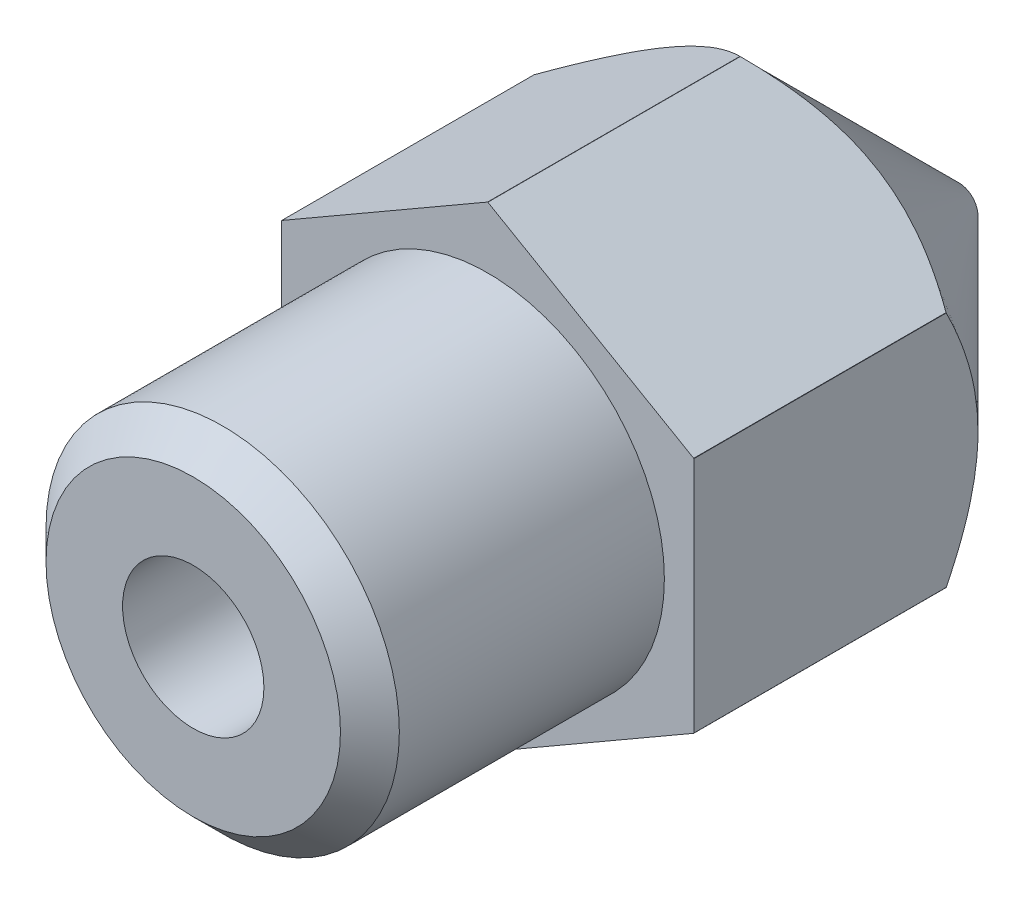
ISO-10303-21;
HEADER;
FILE_DESCRIPTION(('STEP AP214'),'2;1');
FILE_NAME('part.step','',(''),(''),'','','');
FILE_SCHEMA(('AUTOMOTIVE_DESIGN { 1 0 10303 214 1 1 1 1 }'));
ENDSEC;
DATA;
#1=APPLICATION_CONTEXT('core data for automotive mechanical design processes');
#2=APPLICATION_PROTOCOL_DEFINITION('international standard','automotive_design',2000,#1);
#3=PRODUCT_CONTEXT('',#1,'mechanical');
#4=PRODUCT('Part','Part','',(#3));
#5=PRODUCT_RELATED_PRODUCT_CATEGORY('part','',(#4));
#6=PRODUCT_DEFINITION_FORMATION('','',#4);
#7=PRODUCT_DEFINITION_CONTEXT('part definition',#1,'design');
#8=PRODUCT_DEFINITION('design','',#6,#7);
#9=PRODUCT_DEFINITION_SHAPE('','',#8);
#10=(LENGTH_UNIT() NAMED_UNIT(*) SI_UNIT(.MILLI.,.METRE.));
#11=(NAMED_UNIT(*) PLANE_ANGLE_UNIT() SI_UNIT($,.RADIAN.));
#12=(NAMED_UNIT(*) SI_UNIT($,.STERADIAN.) SOLID_ANGLE_UNIT());
#13=UNCERTAINTY_MEASURE_WITH_UNIT(LENGTH_MEASURE(1.E-05),#10,'distance_accuracy_value','');
#14=(GEOMETRIC_REPRESENTATION_CONTEXT(3) GLOBAL_UNCERTAINTY_ASSIGNED_CONTEXT((#13)) GLOBAL_UNIT_ASSIGNED_CONTEXT((#10,
#11,#12)) REPRESENTATION_CONTEXT('',''));
#15=CARTESIAN_POINT('',(0.,0.,0.));
#16=DIRECTION('',(0.,0.,1.));
#17=DIRECTION('',(1.,0.,0.));
#18=AXIS2_PLACEMENT_3D('',#15,#16,#17);
#19=CARTESIAN_POINT('',(-0.2166088223,-17.0652643177,125.63));
#20=DIRECTION('',(0.,0.,1.));
#21=DIRECTION('',(1.,0.,0.));
#22=AXIS2_PLACEMENT_3D('',#19,#20,#21);
#23=CYLINDRICAL_SURFACE('',#22,0.2);
#24=CARTESIAN_POINT('',(-0.2166088223,-17.0652643177,126.129999999932));
#25=DIRECTION('',(0.,0.,1.));
#26=DIRECTION('',(0.,1.,0.));
#27=AXIS2_PLACEMENT_3D('',#24,#25,#26);
#28=CIRCLE('',#27,0.20000000001302);
#29=CARTESIAN_POINT('',(-0.2166088223,-16.865264317687,126.129999999932));
#30=VERTEX_POINT('',#29);
#31=EDGE_CURVE('E333',#30,#30,#28,.T.);
#32=ORIENTED_EDGE('',*,*,#31,.T.);
#33=EDGE_LOOP('',(#32));
#34=FACE_BOUND('',#33,.T.);
#35=CARTESIAN_POINT('',(-0.2166088223,-17.0652643177,125.63));
#36=DIRECTION('',(0.,0.,1.));
#37=DIRECTION('',(1.,0.,0.));
#38=AXIS2_PLACEMENT_3D('',#35,#36,#37);
#39=CIRCLE('',#38,0.2);
#40=CARTESIAN_POINT('',(-0.0166088223,-17.0652643177,125.63));
#41=VERTEX_POINT('',#40);
#42=EDGE_CURVE('E19',#41,#41,#39,.F.);
#43=ORIENTED_EDGE('',*,*,#42,.T.);
#44=EDGE_LOOP('',(#43));
#45=FACE_BOUND('',#44,.T.);
#46=ADVANCED_FACE('F16',(#34,#45),#23,.F.);
#47=CARTESIAN_POINT('',(-0.2166088223,-17.0652643177,125.63));
#48=DIRECTION('',(0.,0.,1.));
#49=DIRECTION('',(1.,0.,0.));
#50=AXIS2_PLACEMENT_3D('',#47,#48,#49);
#51=PLANE('',#50);
#52=ORIENTED_EDGE('',*,*,#42,.F.);
#53=EDGE_LOOP('',(#52));
#54=FACE_BOUND('',#53,.T.);
#55=CARTESIAN_POINT('',(-0.2166088223,-17.0652643177,125.630000000001));
#56=DIRECTION('',(0.,0.,1.));
#57=DIRECTION('',(1.,0.,0.));
#58=AXIS2_PLACEMENT_3D('',#55,#56,#57);
#59=CIRCLE('',#58,0.324999999981642);
#60=CARTESIAN_POINT('',(0.108391177681643,-17.0652643177,125.630000000001));
#61=VERTEX_POINT('',#60);
#62=EDGE_CURVE('E144',#61,#61,#59,.T.);
#63=ORIENTED_EDGE('',*,*,#62,.F.);
#64=EDGE_LOOP('',(#63));
#65=FACE_BOUND('',#64,.T.);
#66=ADVANCED_FACE('F378',(#54,#65),#51,.F.);
#67=CARTESIAN_POINT('',(-0.216608822299999,-17.0652643177,127.862050807551));
#68=DIRECTION('',(0.,0.,1.));
#69=DIRECTION('',(1.,0.,0.));
#70=AXIS2_PLACEMENT_3D('',#67,#68,#69);
#71=CONICAL_SURFACE('',#70,1.20000000004622,0.523598775600348);
#72=CARTESIAN_POINT('',(-0.2166088223,-17.0652643177,127.86205080756));
#73=DIRECTION('',(0.,0.,1.));
#74=DIRECTION('',(1.,0.,0.));
#75=AXIS2_PLACEMENT_3D('',#72,#73,#74);
#76=CIRCLE('',#75,1.2);
#77=CARTESIAN_POINT('',(0.9833911777,-17.0652643177,127.86205080756));
#78=VERTEX_POINT('',#77);
#79=EDGE_CURVE('E131',#78,#78,#76,.T.);
#80=ORIENTED_EDGE('',*,*,#79,.T.);
#81=EDGE_LOOP('',(#80));
#82=FACE_BOUND('',#81,.T.);
#83=ORIENTED_EDGE('',*,*,#31,.F.);
#84=EDGE_LOOP('',(#83));
#85=FACE_BOUND('',#84,.T.);
#86=ADVANCED_FACE('F375',(#82,#85),#71,.F.);
#87=CARTESIAN_POINT('',(-0.2166088223,-17.0652643177,133.63));
#88=DIRECTION('',(0.,0.,-1.));
#89=DIRECTION('',(-1.,0.,0.));
#90=AXIS2_PLACEMENT_3D('',#87,#88,#89);
#91=CYLINDRICAL_SURFACE('',#90,4.04);
#92=CARTESIAN_POINT('',(-0.2166088223,-17.0652643177,133.63));
#93=DIRECTION('',(0.,0.,-1.));
#94=DIRECTION('',(-1.,0.,0.));
#95=AXIS2_PLACEMENT_3D('',#92,#93,#94);
#96=CIRCLE('',#95,4.04);
#97=CARTESIAN_POINT('',(-3.71660882229943,-15.0474437112003,133.63));
#98=VERTEX_POINT('',#97);
#99=CARTESIAN_POINT('',(-3.71409272780585,-15.0430857077009,133.63));
#100=VERTEX_POINT('',#99);
#101=EDGE_CURVE('E122',#98,#100,#96,.T.);
#102=ORIENTED_EDGE('',*,*,#101,.T.);
#103=DIRECTION('',(0.,0.,1.));
#104=VECTOR('',#103,1.);
#105=CARTESIAN_POINT('',(-3.71409272780619,-15.0430857077014,133.63));
#106=LINE('',#105,#104);
#107=CARTESIAN_POINT('',(-3.71409272778886,-15.0430857076914,129.345000000011));
#108=VERTEX_POINT('',#107);
#109=EDGE_CURVE('E120',#108,#100,#106,.T.);
#110=ORIENTED_EDGE('',*,*,#109,.F.);
#111=CARTESIAN_POINT('',(-0.2166088223,-17.0652643177,129.345000000001));
#112=DIRECTION('',(0.,0.,1.));
#113=DIRECTION('',(0.,1.,0.));
#114=AXIS2_PLACEMENT_3D('',#111,#112,#113);
#115=CIRCLE('',#114,4.03999999998133);
#116=CARTESIAN_POINT('',(-3.7166088223,-15.0474437112207,129.345000000001));
#117=VERTEX_POINT('',#116);
#118=EDGE_CURVE('E104',#117,#108,#115,.F.);
#119=ORIENTED_EDGE('',*,*,#118,.F.);
#120=DIRECTION('',(0.,0.,-1.));
#121=VECTOR('',#120,1.);
#122=CARTESIAN_POINT('',(-3.7166088223,-15.0474437112,133.63));
#123=LINE('',#122,#121);
#124=EDGE_CURVE('E266',#117,#98,#123,.F.);
#125=ORIENTED_EDGE('',*,*,#124,.T.);
#126=EDGE_LOOP('',(#102,#110,#119,#125));
#127=FACE_BOUND('',#126,.T.);
#128=ADVANCED_FACE('F121',(#127),#91,.T.);
#129=CARTESIAN_POINT('',(-0.2166088223,-17.0652643177,133.63));
#130=DIRECTION('',(0.,0.,-1.));
#131=DIRECTION('',(-1.,0.,0.));
#132=AXIS2_PLACEMENT_3D('',#129,#130,#131);
#133=CYLINDRICAL_SURFACE('',#132,4.04);
#134=CARTESIAN_POINT('',(-0.2166088223,-17.0652643177,133.63));
#135=DIRECTION('',(0.,0.,-1.));
#136=DIRECTION('',(-1.,0.,0.));
#137=AXIS2_PLACEMENT_3D('',#134,#135,#136);
#138=CIRCLE('',#137,4.04);
#139=CARTESIAN_POINT('',(-3.71409272780752,-19.0874429276897,133.63));
#140=VERTEX_POINT('',#139);
#141=CARTESIAN_POINT('',(-3.71660882230087,-19.0830849241905,133.63));
#142=VERTEX_POINT('',#141);
#143=EDGE_CURVE('E320',#140,#142,#138,.T.);
#144=ORIENTED_EDGE('',*,*,#143,.T.);
#145=DIRECTION('',(0.,0.,-1.));
#146=VECTOR('',#145,1.);
#147=CARTESIAN_POINT('',(-3.7166088223,-19.08308492419,133.63));
#148=LINE('',#147,#146);
#149=CARTESIAN_POINT('',(-3.7166088223,-19.0830849241743,129.345000000009));
#150=VERTEX_POINT('',#149);
#151=EDGE_CURVE('E126',#142,#150,#148,.T.);
#152=ORIENTED_EDGE('',*,*,#151,.T.);
#153=CARTESIAN_POINT('',(-0.2166088223,-17.0652643177,129.345000000001));
#154=DIRECTION('',(0.,0.,1.));
#155=DIRECTION('',(0.,1.,0.));
#156=AXIS2_PLACEMENT_3D('',#153,#154,#155);
#157=CIRCLE('',#156,4.03999999998133);
#158=CARTESIAN_POINT('',(-3.7140927277932,-19.0874429276961,129.345000000001));
#159=VERTEX_POINT('',#158);
#160=EDGE_CURVE('E117',#159,#150,#157,.F.);
#161=ORIENTED_EDGE('',*,*,#160,.F.);
#162=DIRECTION('',(0.,0.,1.));
#163=VECTOR('',#162,1.);
#164=CARTESIAN_POINT('',(-3.71409272780619,-19.0874429276886,133.63));
#165=LINE('',#164,#163);
#166=EDGE_CURVE('E184',#159,#140,#165,.T.);
#167=ORIENTED_EDGE('',*,*,#166,.T.);
#168=EDGE_LOOP('',(#144,#152,#161,#167));
#169=FACE_BOUND('',#168,.T.);
#170=ADVANCED_FACE('F396',(#169),#133,.T.);
#171=CARTESIAN_POINT('',(-0.2166088223,-17.0652643177,133.63));
#172=DIRECTION('',(0.,0.,-1.));
#173=DIRECTION('',(-1.,0.,0.));
#174=AXIS2_PLACEMENT_3D('',#171,#172,#173);
#175=CYLINDRICAL_SURFACE('',#174,4.04);
#176=CARTESIAN_POINT('',(-0.2166088223,-17.0652643177,133.63));
#177=DIRECTION('',(0.,0.,-1.));
#178=DIRECTION('',(-1.,0.,0.));
#179=AXIS2_PLACEMENT_3D('',#176,#177,#178);
#180=CIRCLE('',#179,4.04);
#181=CARTESIAN_POINT('',(-0.214092727807615,-21.1052635341905,133.63));
#182=VERTEX_POINT('',#181);
#183=CARTESIAN_POINT('',(-0.21912491679259,-21.1052635341905,133.63));
#184=VERTEX_POINT('',#183);
#185=EDGE_CURVE('E309',#182,#184,#180,.T.);
#186=ORIENTED_EDGE('',*,*,#185,.T.);
#187=DIRECTION('',(0.,0.,1.));
#188=VECTOR('',#187,1.);
#189=CARTESIAN_POINT('',(-0.219124916791769,-21.1052635341879,133.63));
#190=LINE('',#189,#188);
#191=CARTESIAN_POINT('',(-0.219124916803029,-21.1052635341814,129.345000000007));
#192=VERTEX_POINT('',#191);
#193=EDGE_CURVE('E185',#184,#192,#190,.F.);
#194=ORIENTED_EDGE('',*,*,#193,.T.);
#195=CARTESIAN_POINT('',(-0.2166088223,-17.0652643177,129.345000000001));
#196=DIRECTION('',(0.,0.,1.));
#197=DIRECTION('',(0.,1.,0.));
#198=AXIS2_PLACEMENT_3D('',#195,#196,#197);
#199=CIRCLE('',#198,4.03999999998133);
#200=CARTESIAN_POINT('',(-0.214092727796974,-21.1052635341814,129.345000000001));
#201=VERTEX_POINT('',#200);
#202=EDGE_CURVE('E307',#201,#192,#199,.F.);
#203=ORIENTED_EDGE('',*,*,#202,.F.);
#204=DIRECTION('',(0.,0.,1.));
#205=VECTOR('',#204,1.);
#206=CARTESIAN_POINT('',(-0.214092727808231,-21.1052635341879,133.63));
#207=LINE('',#206,#205);
#208=EDGE_CURVE('E256',#182,#201,#207,.F.);
#209=ORIENTED_EDGE('',*,*,#208,.F.);
#210=EDGE_LOOP('',(#186,#194,#203,#209));
#211=FACE_BOUND('',#210,.T.);
#212=ADVANCED_FACE('F399',(#211),#175,.T.);
#213=CARTESIAN_POINT('',(-0.2166088223,-17.0652643177,133.63));
#214=DIRECTION('',(0.,0.,-1.));
#215=DIRECTION('',(-1.,0.,0.));
#216=AXIS2_PLACEMENT_3D('',#213,#214,#215);
#217=CYLINDRICAL_SURFACE('',#216,4.04);
#218=DIRECTION('',(0.,0.,-1.));
#219=VECTOR('',#218,1.);
#220=CARTESIAN_POINT('',(3.2833911777,-19.08308492419,133.63));
#221=LINE('',#220,#219);
#222=CARTESIAN_POINT('',(3.28339117770087,-19.0830849241905,133.63));
#223=VERTEX_POINT('',#222);
#224=CARTESIAN_POINT('',(3.2833911777,-19.0830849241743,129.345000000001));
#225=VERTEX_POINT('',#224);
#226=EDGE_CURVE('E242',#223,#225,#221,.T.);
#227=ORIENTED_EDGE('',*,*,#226,.F.);
#228=CARTESIAN_POINT('',(-0.2166088223,-17.0652643177,133.63));
#229=DIRECTION('',(0.,0.,-1.));
#230=DIRECTION('',(-1.,0.,0.));
#231=AXIS2_PLACEMENT_3D('',#228,#229,#230);
#232=CIRCLE('',#231,4.04);
#233=CARTESIAN_POINT('',(3.28087508320753,-19.0874429276898,133.63));
#234=VERTEX_POINT('',#233);
#235=EDGE_CURVE('E299',#223,#234,#232,.T.);
#236=ORIENTED_EDGE('',*,*,#235,.T.);
#237=DIRECTION('',(0.,0.,1.));
#238=VECTOR('',#237,1.);
#239=CARTESIAN_POINT('',(3.28087508320619,-19.0874429276886,133.63));
#240=LINE('',#239,#238);
#241=CARTESIAN_POINT('',(3.2808750831932,-19.0874429276961,129.345000000008));
#242=VERTEX_POINT('',#241);
#243=EDGE_CURVE('E245',#242,#234,#240,.T.);
#244=ORIENTED_EDGE('',*,*,#243,.F.);
#245=CARTESIAN_POINT('',(-0.2166088223,-17.0652643177,129.345000000001));
#246=DIRECTION('',(0.,0.,1.));
#247=DIRECTION('',(0.,1.,0.));
#248=AXIS2_PLACEMENT_3D('',#245,#246,#247);
#249=CIRCLE('',#248,4.03999999998133);
#250=EDGE_CURVE('E296',#225,#242,#249,.F.);
#251=ORIENTED_EDGE('',*,*,#250,.F.);
#252=EDGE_LOOP('',(#227,#236,#244,#251));
#253=FACE_BOUND('',#252,.T.);
#254=ADVANCED_FACE('F402',(#253),#217,.T.);
#255=CARTESIAN_POINT('',(-0.2166088223,-17.0652643177,133.63));
#256=DIRECTION('',(0.,0.,-1.));
#257=DIRECTION('',(-1.,0.,0.));
#258=AXIS2_PLACEMENT_3D('',#255,#256,#257);
#259=CYLINDRICAL_SURFACE('',#258,4.04);
#260=DIRECTION('',(0.,0.,1.));
#261=VECTOR('',#260,1.);
#262=CARTESIAN_POINT('',(3.28087508320823,-15.0430857076979,133.63));
#263=LINE('',#262,#261);
#264=CARTESIAN_POINT('',(3.28087508320652,-15.0430857076996,133.63));
#265=VERTEX_POINT('',#264);
#266=CARTESIAN_POINT('',(3.28087508318784,-15.0430857076861,129.345000000001));
#267=VERTEX_POINT('',#266);
#268=EDGE_CURVE('E243',#265,#267,#263,.F.);
#269=ORIENTED_EDGE('',*,*,#268,.F.);
#270=CARTESIAN_POINT('',(-0.2166088223,-17.0652643177,133.63));
#271=DIRECTION('',(0.,0.,-1.));
#272=DIRECTION('',(-1.,0.,0.));
#273=AXIS2_PLACEMENT_3D('',#270,#271,#272);
#274=CIRCLE('',#273,4.04);
#275=CARTESIAN_POINT('',(3.28339117769943,-15.0474437112004,133.63));
#276=VERTEX_POINT('',#275);
#277=EDGE_CURVE('E297',#265,#276,#274,.T.);
#278=ORIENTED_EDGE('',*,*,#277,.T.);
#279=DIRECTION('',(0.,0.,-1.));
#280=VECTOR('',#279,1.);
#281=CARTESIAN_POINT('',(3.2833911777,-15.0474437112,133.63));
#282=LINE('',#281,#280);
#283=CARTESIAN_POINT('',(3.2833911777,-15.0474437112207,129.345000000011));
#284=VERTEX_POINT('',#283);
#285=EDGE_CURVE('E239',#284,#276,#282,.F.);
#286=ORIENTED_EDGE('',*,*,#285,.F.);
#287=CARTESIAN_POINT('',(-0.2166088223,-17.0652643177,129.345000000001));
#288=DIRECTION('',(0.,0.,1.));
#289=DIRECTION('',(0.,1.,0.));
#290=AXIS2_PLACEMENT_3D('',#287,#288,#289);
#291=CIRCLE('',#290,4.03999999998133);
#292=EDGE_CURVE('E294',#267,#284,#291,.F.);
#293=ORIENTED_EDGE('',*,*,#292,.F.);
#294=EDGE_LOOP('',(#269,#278,#286,#293));
#295=FACE_BOUND('',#294,.T.);
#296=ADVANCED_FACE('F152',(#295),#259,.T.);
#297=CARTESIAN_POINT('',(-0.2166088223,-17.0652643177,129.345000000058));
#298=DIRECTION('',(0.,0.,1.));
#299=DIRECTION('',(1.,0.,0.));
#300=AXIS2_PLACEMENT_3D('',#297,#298,#299);
#301=CONICAL_SURFACE('',#300,4.04000000003818,0.785398163397448);
#302=CARTESIAN_POINT('',(-0.219124916802233,-13.0252651012076,129.345000000018));
#303=CARTESIAN_POINT('',(-0.33927015428237,-13.094630986409,129.275774840659));
#304=CARTESIAN_POINT('',(-0.461422701634482,-13.1651557925051,129.210622890685));
#305=CARTESIAN_POINT('',(-0.710495407702024,-13.3089579864012,129.091344654386));
#306=CARTESIAN_POINT('',(-0.837439107572412,-13.3822489656933,129.037284502365));
#307=CARTESIAN_POINT('',(-1.09341317875045,-13.5300356645935,128.94468597697));
#308=CARTESIAN_POINT('',(-1.22237875070989,-13.6044939722806,128.905915538767));
#309=CARTESIAN_POINT('',(-1.48314097540406,-13.7550451129023,128.846188889384));
#310=CARTESIAN_POINT('',(-1.614929723699,-13.8311333822066,128.825188280028));
#311=CARTESIAN_POINT('',(-1.84219844470857,-13.9623470394599,128.806235193616));
#312=CARTESIAN_POINT('',(-1.93738707452634,-14.017304220509,128.803438549926));
#313=CARTESIAN_POINT('',(-2.12760799384724,-14.1271283194845,128.808215092515));
#314=CARTESIAN_POINT('',(-2.22264021700774,-14.1819951991079,128.815791906852));
#315=CARTESIAN_POINT('',(-2.4118026976506,-14.2912082082277,128.84088266067));
#316=CARTESIAN_POINT('',(-2.5059318331084,-14.3455536899229,128.858407654472));
#317=CARTESIAN_POINT('',(-2.69257289849409,-14.4533109592652,128.902438581097));
#318=CARTESIAN_POINT('',(-2.78508495233469,-14.5067228184534,128.928943822586));
#319=CARTESIAN_POINT('',(-2.94905033180317,-14.6013882744274,128.983382150048));
#320=CARTESIAN_POINT('',(-3.02087185803901,-14.6428544519333,129.009864691701));
#321=CARTESIAN_POINT('',(-3.16323028929422,-14.7250451305399,129.067083015351));
#322=CARTESIAN_POINT('',(-3.23376716053279,-14.7657696121373,129.097818909011));
#323=CARTESIAN_POINT('',(-3.37333358275448,-14.8463483235769,129.162858692339));
#324=CARTESIAN_POINT('',(-3.44236709758791,-14.8862048419491,129.197151334449));
#325=CARTESIAN_POINT('',(-3.57916063016628,-14.9651826248066,129.268857758395));
#326=CARTESIAN_POINT('',(-3.64692138653187,-15.0043043157348,129.306269656864));
#327=CARTESIAN_POINT('',(-3.71409272779723,-15.0430857076962,129.345000000016));
#328=B_SPLINE_CURVE_WITH_KNOTS('',3,(#302,#303,#304,#305,#306,#307,#308,#309,#310,#311,#312,
#313,#314,#315,#316,#317,#318,#319,#320,#321,#322,#323,#324,#325,#326,#327),.UNSPECIFIED.,.F.,
.F.,(4,2,2,2,2,2,2,2,2,2,2,2,4),(0.,0.465452894214237,0.933605168055278,1.3943499151764,
1.85394005677302,2.18332351499273,2.51282220261936,2.84268774472414,3.17252789830372,
3.4335806232525,3.69464020286406,3.95489804276275,4.21499986468729),.UNSPECIFIED.);
#329=CARTESIAN_POINT('',(-0.219124916811697,-13.0252651012136,129.345000000001));
#330=VERTEX_POINT('',#329);
#331=EDGE_CURVE('E109',#330,#108,#328,.T.);
#332=ORIENTED_EDGE('',*,*,#331,.F.);
#333=CARTESIAN_POINT('',(-0.216608822300003,-17.0652643177,129.345));
#334=DIRECTION('',(0.,0.,-1.));
#335=DIRECTION('',(-1.,0.,0.));
#336=AXIS2_PLACEMENT_3D('',#333,#334,#335);
#337=CIRCLE('',#336,4.04);
#338=CARTESIAN_POINT('',(-0.214092727799382,-13.0252651012025,129.345000000014));
#339=VERTEX_POINT('',#338);
#340=EDGE_CURVE('E99',#339,#330,#337,.F.);
#341=ORIENTED_EDGE('',*,*,#340,.F.);
#342=CARTESIAN_POINT('',(3.28087508319829,-15.0430857076917,129.345000000018));
#343=CARTESIAN_POINT('',(3.16072984571819,-14.973719822491,129.27577484066));
#344=CARTESIAN_POINT('',(3.03857729836627,-14.9031950163952,129.210622890687));
#345=CARTESIAN_POINT('',(2.78950459229927,-14.7593928224996,129.091344654388));
#346=CARTESIAN_POINT('',(2.66256089242924,-14.6861018432077,129.037284502367));
#347=CARTESIAN_POINT('',(2.4065868212519,-14.5383151443078,128.944685976973));
#348=CARTESIAN_POINT('',(2.2776212492928,-14.463856836621,128.90591553877));
#349=CARTESIAN_POINT('',(2.01685902459937,-14.3133056959997,128.846188889388));
#350=CARTESIAN_POINT('',(1.88507027630481,-14.2372174266956,128.825188280032));
#351=CARTESIAN_POINT('',(1.65780155529555,-14.1060037694425,128.80623519362));
#352=CARTESIAN_POINT('',(1.5626129254777,-14.0510465883933,128.80343854993));
#353=CARTESIAN_POINT('',(1.37239200615663,-13.9412224894177,128.80821509252));
#354=CARTESIAN_POINT('',(1.27735978299604,-13.8863556097942,128.815791906856));
#355=CARTESIAN_POINT('',(1.08819730235302,-13.7771426006744,128.840882660674));
#356=CARTESIAN_POINT('',(0.994068166895133,-13.7227971189791,128.858407654477));
#357=CARTESIAN_POINT('',(0.807427101509272,-13.6150398496367,128.902438581101));
#358=CARTESIAN_POINT('',(0.714915047668595,-13.5616279904485,128.92894382259));
#359=CARTESIAN_POINT('',(0.550949668199817,-13.4669625344744,128.983382150053));
#360=CARTESIAN_POINT('',(0.479128141963763,-13.4254963569683,129.009864691706));
#361=CARTESIAN_POINT('',(0.336769710708124,-13.3433056783614,129.067083015356));
#362=CARTESIAN_POINT('',(0.266232839469348,-13.3025811967639,129.097818909016));
#363=CARTESIAN_POINT('',(0.126666417247241,-13.2220024853241,129.162858692344));
#364=CARTESIAN_POINT('',(0.0576329024136132,-13.1821459669518,129.197151334454));
#365=CARTESIAN_POINT('',(-0.0791606301651576,-13.103168184094,129.268857758401));
#366=CARTESIAN_POINT('',(-0.146921386530942,-13.0640464931657,129.306269656869));
#367=CARTESIAN_POINT('',(-0.214092727796492,-13.0252651012042,129.345000000022));
#368=B_SPLINE_CURVE_WITH_KNOTS('',3,(#342,#343,#344,#345,#346,#347,#348,#349,#350,#351,#352,
#353,#354,#355,#356,#357,#358,#359,#360,#361,#362,#363,#364,#365,#366,#367),.UNSPECIFIED.,.F.,
.F.,(4,2,2,2,2,2,2,2,2,2,2,2,4),(0.,0.465452894212852,0.933605168052482,1.39434991517221,
1.85394005676747,2.18332351498747,2.5128222026144,2.84268774471948,3.17252789829938,
3.43358062324897,3.69464020286134,3.95489804276083,4.21499986468618),.UNSPECIFIED.);
#369=EDGE_CURVE('E159',#267,#339,#368,.T.);
#370=ORIENTED_EDGE('',*,*,#369,.F.);
#371=ORIENTED_EDGE('',*,*,#292,.T.);
#372=CARTESIAN_POINT('',(3.2833911777,-19.083084924182,129.345000000012));
#373=CARTESIAN_POINT('',(3.2833911777,-18.9443531537803,129.275774840654));
#374=CARTESIAN_POINT('',(3.2833911777,-18.8033035415888,129.210622890681));
#375=CARTESIAN_POINT('',(3.2833911777,-18.515699153798,129.091344654382));
#376=CARTESIAN_POINT('',(3.2833911777,-18.3691171952144,129.037284502361));
#377=CARTESIAN_POINT('',(3.2833911777,-18.073543797415,128.944685976967));
#378=CARTESIAN_POINT('',(3.2833911777,-17.9246271820416,128.905915538764));
#379=CARTESIAN_POINT('',(3.2833911777,-17.6235249007994,128.846188889382));
#380=CARTESIAN_POINT('',(3.2833911777,-17.4713483621915,128.825188280026));
#381=CARTESIAN_POINT('',(3.2833911777,-17.2089210476857,128.806235193614));
#382=CARTESIAN_POINT('',(3.2833911777,-17.0990066855876,128.803438549925));
#383=CARTESIAN_POINT('',(3.2833911777,-16.8793584876369,128.808215092514));
#384=CARTESIAN_POINT('',(3.2833911777,-16.7696247283901,128.81579190685));
#385=CARTESIAN_POINT('',(3.2833911777,-16.5511987101508,128.840882660668));
#386=CARTESIAN_POINT('',(3.2833911777,-16.4425077467606,128.85840765447));
#387=CARTESIAN_POINT('',(3.2833911777,-16.2269932080762,128.902438581095));
#388=CARTESIAN_POINT('',(3.2833911777,-16.1201694897,128.928943822584));
#389=CARTESIAN_POINT('',(3.2833911777,-15.9308385777518,128.983382150046));
#390=CARTESIAN_POINT('',(3.2833911777,-15.8479062227397,129.0098646917));
#391=CARTESIAN_POINT('',(3.2833911777,-15.6835248655257,129.06708301535));
#392=CARTESIAN_POINT('',(3.2833911777,-15.6020759023306,129.09781890901));
#393=CARTESIAN_POINT('',(3.2833911777,-15.4409184794508,129.162858692338));
#394=CARTESIAN_POINT('',(3.2833911777,-15.3612054427061,129.197151334448));
#395=CARTESIAN_POINT('',(3.2833911777,-15.2032498769903,129.268857758395));
#396=CARTESIAN_POINT('',(3.2833911777,-15.1250064951336,129.306269656864));
#397=CARTESIAN_POINT('',(3.2833911777,-15.0474437112106,129.345000000016));
#398=B_SPLINE_CURVE_WITH_KNOTS('',3,(#372,#373,#374,#375,#376,#377,#378,#379,#380,#381,#382,
#383,#384,#385,#386,#387,#388,#389,#390,#391,#392,#393,#394,#395,#396,#397),.UNSPECIFIED.,.F.,
.F.,(4,2,2,2,2,2,2,2,2,2,2,2,4),(0.,0.465452894212396,0.93360516805157,1.39434991517083,
1.85394005676561,2.18332351498506,2.51282220261143,2.84268774471595,3.17252789829529,
3.4335806232453,3.69464020285807,3.95489804275796,4.21499986468369),.UNSPECIFIED.);
#399=EDGE_CURVE('E167',#225,#284,#398,.T.);
#400=ORIENTED_EDGE('',*,*,#399,.F.);
#401=ORIENTED_EDGE('',*,*,#250,.T.);
#402=CARTESIAN_POINT('',(-0.21409272780224,-21.1052635341844,129.34500000001));
#403=CARTESIAN_POINT('',(-0.0939474903220502,-21.0358976489833,129.275774840651));
#404=CARTESIAN_POINT('',(0.0282050570300573,-20.9653728428874,129.210622890678));
#405=CARTESIAN_POINT('',(0.277277763097548,-20.8215706489914,129.091344654378));
#406=CARTESIAN_POINT('',(0.40422146296789,-20.7482796696993,129.037284502357));
#407=CARTESIAN_POINT('',(0.660195534145842,-20.6004929707991,128.944685976962));
#408=CARTESIAN_POINT('',(0.789161106105236,-20.5260346631121,128.905915538758));
#409=CARTESIAN_POINT('',(1.04992333079932,-20.3754835224904,128.846188889376));
#410=CARTESIAN_POINT('',(1.18171207909422,-20.2993952531862,128.825188280019));
#411=CARTESIAN_POINT('',(1.40898080010353,-20.168181595933,128.806235193608));
#412=CARTESIAN_POINT('',(1.50416942992106,-20.113224414884,128.803438549918));
#413=CARTESIAN_POINT('',(1.6943903492415,-20.0034003159088,128.808215092507));
#414=CARTESIAN_POINT('',(1.78942257240178,-19.9485334362855,128.815791906843));
#415=CARTESIAN_POINT('',(1.97858505304419,-19.839320427166,128.840882660661));
#416=CARTESIAN_POINT('',(2.07271418850177,-19.7849749454709,128.858407654463));
#417=CARTESIAN_POINT('',(2.25935525388703,-19.6772176761288,128.902438581088));
#418=CARTESIAN_POINT('',(2.35186730772742,-19.6238058169408,128.928943822577));
#419=CARTESIAN_POINT('',(2.51583268719656,-19.5291403609665,128.983382150039));
#420=CARTESIAN_POINT('',(2.58765421343326,-19.4876741834601,129.009864691692));
#421=CARTESIAN_POINT('',(2.73001264469015,-19.4054835048524,129.067083015343));
#422=CARTESIAN_POINT('',(2.80054951592954,-19.3647590232546,129.097818909003));
#423=CARTESIAN_POINT('',(2.94011593815284,-19.2841803118141,129.162858692332));
#424=CARTESIAN_POINT('',(3.00914945298706,-19.2443237934414,129.197151334443));
#425=CARTESIAN_POINT('',(3.14594298556697,-19.165346010583,129.26885775839));
#426=CARTESIAN_POINT('',(3.21370374193331,-19.1262243196543,129.306269656859));
#427=CARTESIAN_POINT('',(3.2808750831994,-19.0874429276925,129.345000000012));
#428=B_SPLINE_CURVE_WITH_KNOTS('',3,(#402,#403,#404,#405,#406,#407,#408,#409,#410,#411,#412,
#413,#414,#415,#416,#417,#418,#419,#420,#421,#422,#423,#424,#425,#426,#427),.UNSPECIFIED.,.F.,
.F.,(4,2,2,2,2,2,2,2,2,2,2,2,4),(0.,0.465452894214223,0.933605168055257,1.39434991517627,
1.8539400567728,2.18332351499171,2.51282220261755,2.84268774472153,3.17252789830034,
3.43358062325225,3.69464020286694,3.95489804276874,4.21499986469639),.UNSPECIFIED.);
#429=EDGE_CURVE('E173',#201,#242,#428,.T.);
#430=ORIENTED_EDGE('',*,*,#429,.F.);
#431=ORIENTED_EDGE('',*,*,#202,.T.);
#432=CARTESIAN_POINT('',(-0.219124916797763,-21.1052635341844,129.34500000001));
#433=CARTESIAN_POINT('',(-0.339270154277953,-21.0358976489833,129.275774840651));
#434=CARTESIAN_POINT('',(-0.461422701630059,-20.9653728428874,129.210622890678));
#435=CARTESIAN_POINT('',(-0.710495407697548,-20.8215706489914,129.091344654378));
#436=CARTESIAN_POINT('',(-0.837439107567888,-20.7482796696993,129.037284502357));
#437=CARTESIAN_POINT('',(-1.09341317874584,-20.6004929707991,128.944685976962));
#438=CARTESIAN_POINT('',(-1.22237875070524,-20.5260346631121,128.905915538758));
#439=CARTESIAN_POINT('',(-1.48314097539932,-20.3754835224904,128.846188889376));
#440=CARTESIAN_POINT('',(-1.61492972369423,-20.2993952531862,128.825188280019));
#441=CARTESIAN_POINT('',(-1.84219844470353,-20.168181595933,128.806235193608));
#442=CARTESIAN_POINT('',(-1.93738707452106,-20.113224414884,128.803438549918));
#443=CARTESIAN_POINT('',(-2.12760799384151,-20.0034003159088,128.808215092507));
#444=CARTESIAN_POINT('',(-2.22264021700179,-19.9485334362855,128.815791906843));
#445=CARTESIAN_POINT('',(-2.4118026976442,-19.839320427166,128.840882660661));
#446=CARTESIAN_POINT('',(-2.50593183310177,-19.7849749454709,128.858407654463));
#447=CARTESIAN_POINT('',(-2.69257289848704,-19.6772176761288,128.902438581088));
#448=CARTESIAN_POINT('',(-2.78508495232742,-19.6238058169408,128.928943822577));
#449=CARTESIAN_POINT('',(-2.94905033179656,-19.5291403609665,128.983382150039));
#450=CARTESIAN_POINT('',(-3.02087185803325,-19.4876741834601,129.009864691692));
#451=CARTESIAN_POINT('',(-3.16323028929015,-19.4054835048524,129.067083015343));
#452=CARTESIAN_POINT('',(-3.23376716052954,-19.3647590232546,129.097818909003));
#453=CARTESIAN_POINT('',(-3.37333358275284,-19.2841803118141,129.162858692332));
#454=CARTESIAN_POINT('',(-3.44236709758705,-19.2443237934414,129.197151334443));
#455=CARTESIAN_POINT('',(-3.57916063016697,-19.165346010583,129.26885775839));
#456=CARTESIAN_POINT('',(-3.64692138653331,-19.1262243196543,129.306269656859));
#457=CARTESIAN_POINT('',(-3.7140927277994,-19.0874429276925,129.345000000012));
#458=B_SPLINE_CURVE_WITH_KNOTS('',3,(#432,#433,#434,#435,#436,#437,#438,#439,#440,#441,#442,
#443,#444,#445,#446,#447,#448,#449,#450,#451,#452,#453,#454,#455,#456,#457),.UNSPECIFIED.,.F.,
.F.,(4,2,2,2,2,2,2,2,2,2,2,2,4),(0.,0.465452894214224,0.933605168055252,1.39434991517628,
1.8539400567728,2.18332351499171,2.51282220261755,2.84268774472154,3.17252789830034,
3.43358062325224,3.69464020286694,3.95489804276874,4.21499986469638),.UNSPECIFIED.);
#459=EDGE_CURVE('E178',#192,#159,#458,.T.);
#460=ORIENTED_EDGE('',*,*,#459,.T.);
#461=ORIENTED_EDGE('',*,*,#160,.T.);
#462=CARTESIAN_POINT('',(-3.7166088223,-19.083084924182,129.345000000012));
#463=CARTESIAN_POINT('',(-3.7166088223,-18.9443531537803,129.275774840654));
#464=CARTESIAN_POINT('',(-3.7166088223,-18.8033035415888,129.210622890681));
#465=CARTESIAN_POINT('',(-3.7166088223,-18.515699153798,129.091344654382));
#466=CARTESIAN_POINT('',(-3.7166088223,-18.3691171952143,129.037284502361));
#467=CARTESIAN_POINT('',(-3.7166088223,-18.073543797415,128.944685976967));
#468=CARTESIAN_POINT('',(-3.7166088223,-17.9246271820416,128.905915538764));
#469=CARTESIAN_POINT('',(-3.7166088223,-17.6235249007994,128.846188889382));
#470=CARTESIAN_POINT('',(-3.7166088223,-17.4713483621915,128.825188280026));
#471=CARTESIAN_POINT('',(-3.7166088223,-17.2089210476856,128.806235193614));
#472=CARTESIAN_POINT('',(-3.7166088223,-17.0990066855875,128.803438549925));
#473=CARTESIAN_POINT('',(-3.7166088223,-16.8793584876368,128.808215092514));
#474=CARTESIAN_POINT('',(-3.7166088223,-16.7696247283901,128.81579190685));
#475=CARTESIAN_POINT('',(-3.7166088223,-16.5511987101508,128.840882660668));
#476=CARTESIAN_POINT('',(-3.7166088223,-16.4425077467605,128.858407654471));
#477=CARTESIAN_POINT('',(-3.7166088223,-16.2269932080761,128.902438581095));
#478=CARTESIAN_POINT('',(-3.7166088223,-16.1201694896999,128.928943822584));
#479=CARTESIAN_POINT('',(-3.7166088223,-15.9308385777518,128.983382150046));
#480=CARTESIAN_POINT('',(-3.7166088223,-15.8479062227396,129.0098646917));
#481=CARTESIAN_POINT('',(-3.7166088223,-15.6835248655257,129.06708301535));
#482=CARTESIAN_POINT('',(-3.7166088223,-15.6020759023305,129.09781890901));
#483=CARTESIAN_POINT('',(-3.7166088223,-15.4409184794508,129.162858692338));
#484=CARTESIAN_POINT('',(-3.7166088223,-15.3612054427061,129.197151334448));
#485=CARTESIAN_POINT('',(-3.7166088223,-15.2032498769903,129.268857758395));
#486=CARTESIAN_POINT('',(-3.7166088223,-15.1250064951336,129.306269656864));
#487=CARTESIAN_POINT('',(-3.7166088223,-15.0474437112105,129.345000000016));
#488=B_SPLINE_CURVE_WITH_KNOTS('',3,(#462,#463,#464,#465,#466,#467,#468,#469,#470,#471,#472,
#473,#474,#475,#476,#477,#478,#479,#480,#481,#482,#483,#484,#485,#486,#487),.UNSPECIFIED.,.F.,
.F.,(4,2,2,2,2,2,2,2,2,2,2,2,4),(0.,0.465452894212415,0.933605168051599,1.39434991517087,
1.85394005676566,2.1833235149851,2.51282220261148,2.84268774471601,3.17252789829536,
3.43358062324534,3.69464020285811,3.95489804275796,4.21499986468369),.UNSPECIFIED.);
#489=EDGE_CURVE('E113',#150,#117,#488,.T.);
#490=ORIENTED_EDGE('',*,*,#489,.T.);
#491=ORIENTED_EDGE('',*,*,#118,.T.);
#492=EDGE_LOOP('',(#332,#341,#370,#371,#400,#401,#430,#431,#460,#461,#490,#491));
#493=FACE_BOUND('',#492,.T.);
#494=ORIENTED_EDGE('',*,*,#62,.T.);
#495=EDGE_LOOP('',(#494));
#496=FACE_BOUND('',#495,.T.);
#497=ADVANCED_FACE('F106',(#493,#496),#301,.T.);
#498=CARTESIAN_POINT('',(-0.2166088223,-17.0652643177,133.63));
#499=DIRECTION('',(0.,0.,-1.));
#500=DIRECTION('',(-1.,0.,0.));
#501=AXIS2_PLACEMENT_3D('',#498,#499,#500);
#502=CYLINDRICAL_SURFACE('',#501,4.04);
#503=ORIENTED_EDGE('',*,*,#340,.T.);
#504=DIRECTION('',(0.,0.,1.));
#505=VECTOR('',#504,1.);
#506=CARTESIAN_POINT('',(-0.21912491679177,-13.0252651012021,133.63));
#507=LINE('',#506,#505);
#508=CARTESIAN_POINT('',(-0.219124577486317,-13.0252649705491,133.63));
#509=VERTEX_POINT('',#508);
#510=EDGE_CURVE('E129',#509,#330,#507,.F.);
#511=ORIENTED_EDGE('',*,*,#510,.F.);
#512=CARTESIAN_POINT('',(-0.2166088223,-17.0652643177,133.63));
#513=DIRECTION('',(0.,0.,-1.));
#514=DIRECTION('',(-1.,0.,0.));
#515=AXIS2_PLACEMENT_3D('',#512,#513,#514);
#516=CIRCLE('',#515,4.04);
#517=CARTESIAN_POINT('',(-0.214092727806462,-13.0252651012017,133.63));
#518=VERTEX_POINT('',#517);
#519=EDGE_CURVE('E34',#509,#518,#516,.T.);
#520=ORIENTED_EDGE('',*,*,#519,.T.);
#521=DIRECTION('',(0.,0.,1.));
#522=VECTOR('',#521,1.);
#523=CARTESIAN_POINT('',(-0.214092727806189,-13.0252651011986,133.63));
#524=LINE('',#523,#522);
#525=EDGE_CURVE('E350',#339,#518,#524,.T.);
#526=ORIENTED_EDGE('',*,*,#525,.F.);
#527=EDGE_LOOP('',(#503,#511,#520,#526));
#528=FACE_BOUND('',#527,.T.);
#529=ADVANCED_FACE('F151',(#528),#502,.T.);
#530=CARTESIAN_POINT('',(-0.2166088223,-17.0652643177,127.86205080756));
#531=DIRECTION('',(0.,0.,1.));
#532=DIRECTION('',(1.,0.,0.));
#533=AXIS2_PLACEMENT_3D('',#530,#531,#532);
#534=CYLINDRICAL_SURFACE('',#533,1.2);
#535=CARTESIAN_POINT('',(-0.216608822299993,-17.0652643177,138.63));
#536=DIRECTION('',(0.,0.,1.));
#537=DIRECTION('',(1.,0.,0.));
#538=AXIS2_PLACEMENT_3D('',#535,#536,#537);
#539=CIRCLE('',#538,1.2);
#540=CARTESIAN_POINT('',(0.983391177700007,-17.0652643177,138.63));
#541=VERTEX_POINT('',#540);
#542=EDGE_CURVE('E342',#541,#541,#539,.F.);
#543=ORIENTED_EDGE('',*,*,#542,.F.);
#544=EDGE_LOOP('',(#543));
#545=FACE_BOUND('',#544,.T.);
#546=ORIENTED_EDGE('',*,*,#79,.F.);
#547=EDGE_LOOP('',(#546));
#548=FACE_BOUND('',#547,.T.);
#549=ADVANCED_FACE('F200',(#545,#548),#534,.F.);
#550=CARTESIAN_POINT('',(-0.2166088223,-13.02381243337,133.63));
#551=DIRECTION('',(-0.50000000000019,0.866025403784329,0.));
#552=DIRECTION('',(-0.866025403784329,-0.50000000000019,0.));
#553=AXIS2_PLACEMENT_3D('',#550,#551,#552);
#554=PLANE('',#553);
#555=ORIENTED_EDGE('',*,*,#331,.T.);
#556=ORIENTED_EDGE('',*,*,#109,.T.);
#557=DIRECTION('',(-0.866025403784225,-0.50000000000037,0.));
#558=VECTOR('',#557,1.);
#559=CARTESIAN_POINT('',(-0.219124916793,-13.0252651012,133.63));
#560=LINE('',#559,#558);
#561=EDGE_CURVE('E338',#509,#100,#560,.T.);
#562=ORIENTED_EDGE('',*,*,#561,.F.);
#563=ORIENTED_EDGE('',*,*,#510,.T.);
#564=EDGE_LOOP('',(#555,#556,#562,#563));
#565=FACE_BOUND('',#564,.T.);
#566=ADVANCED_FACE('F128',(#565),#554,.T.);
#567=CARTESIAN_POINT('',(-3.7166088223,-19.08599025986,133.63));
#568=DIRECTION('',(1.,0.,0.));
#569=DIRECTION('',(0.,0.,-1.));
#570=AXIS2_PLACEMENT_3D('',#567,#568,#569);
#571=PLANE('',#570);
#572=ORIENTED_EDGE('',*,*,#489,.F.);
#573=ORIENTED_EDGE('',*,*,#151,.F.);
#574=DIRECTION('',(0.,1.,0.));
#575=VECTOR('',#574,1.);
#576=CARTESIAN_POINT('',(-3.7166088223,-17.0652643177,133.63));
#577=LINE('',#576,#575);
#578=EDGE_CURVE('E328',#98,#142,#577,.F.);
#579=ORIENTED_EDGE('',*,*,#578,.F.);
#580=ORIENTED_EDGE('',*,*,#124,.F.);
#581=EDGE_LOOP('',(#572,#573,#579,#580));
#582=FACE_BOUND('',#581,.T.);
#583=ADVANCED_FACE('F190',(#582),#571,.F.);
#584=CARTESIAN_POINT('',(-0.2166088223,-21.10671620202,133.63));
#585=DIRECTION('',(0.50000000000019,0.866025403784329,0.));
#586=DIRECTION('',(-0.866025403784329,0.50000000000019,0.));
#587=AXIS2_PLACEMENT_3D('',#584,#585,#586);
#588=PLANE('',#587);
#589=ORIENTED_EDGE('',*,*,#459,.F.);
#590=ORIENTED_EDGE('',*,*,#193,.F.);
#591=DIRECTION('',(0.866025403784225,-0.50000000000037,0.));
#592=VECTOR('',#591,1.);
#593=CARTESIAN_POINT('',(-3.714092727807,-19.08744292769,133.63));
#594=LINE('',#593,#592);
#595=EDGE_CURVE('E314',#140,#184,#594,.T.);
#596=ORIENTED_EDGE('',*,*,#595,.F.);
#597=ORIENTED_EDGE('',*,*,#166,.F.);
#598=EDGE_LOOP('',(#589,#590,#596,#597));
#599=FACE_BOUND('',#598,.T.);
#600=ADVANCED_FACE('F186',(#599),#588,.F.);
#601=CARTESIAN_POINT('',(-0.2166088223,-21.10671620202,133.63));
#602=DIRECTION('',(0.50000000000019,-0.866025403784329,0.));
#603=DIRECTION('',(0.866025403784329,0.50000000000019,0.));
#604=AXIS2_PLACEMENT_3D('',#601,#602,#603);
#605=PLANE('',#604);
#606=ORIENTED_EDGE('',*,*,#429,.T.);
#607=ORIENTED_EDGE('',*,*,#243,.T.);
#608=DIRECTION('',(0.866025403784225,0.50000000000037,0.));
#609=VECTOR('',#608,1.);
#610=CARTESIAN_POINT('',(-0.214092727807,-21.10526353419,133.63));
#611=LINE('',#610,#609);
#612=EDGE_CURVE('E303',#182,#234,#611,.T.);
#613=ORIENTED_EDGE('',*,*,#612,.F.);
#614=ORIENTED_EDGE('',*,*,#208,.T.);
#615=EDGE_LOOP('',(#606,#607,#613,#614));
#616=FACE_BOUND('',#615,.T.);
#617=ADVANCED_FACE('F189',(#616),#605,.T.);
#618=CARTESIAN_POINT('',(3.2833911777,-19.08599025986,133.63));
#619=DIRECTION('',(1.,0.,0.));
#620=DIRECTION('',(0.,0.,-1.));
#621=AXIS2_PLACEMENT_3D('',#618,#619,#620);
#622=PLANE('',#621);
#623=ORIENTED_EDGE('',*,*,#399,.T.);
#624=ORIENTED_EDGE('',*,*,#285,.T.);
#625=DIRECTION('',(0.,1.,0.));
#626=VECTOR('',#625,1.);
#627=CARTESIAN_POINT('',(3.2833911777,-17.0652643177,133.63));
#628=LINE('',#627,#626);
#629=EDGE_CURVE('E291',#223,#276,#628,.T.);
#630=ORIENTED_EDGE('',*,*,#629,.F.);
#631=ORIENTED_EDGE('',*,*,#226,.T.);
#632=EDGE_LOOP('',(#623,#624,#630,#631));
#633=FACE_BOUND('',#632,.T.);
#634=ADVANCED_FACE('F224',(#633),#622,.T.);
#635=CARTESIAN_POINT('',(3.2833911777,-15.04453837553,133.63));
#636=DIRECTION('',(0.50000000000019,0.866025403784329,0.));
#637=DIRECTION('',(-0.866025403784329,0.50000000000019,0.));
#638=AXIS2_PLACEMENT_3D('',#635,#636,#637);
#639=PLANE('',#638);
#640=ORIENTED_EDGE('',*,*,#369,.T.);
#641=ORIENTED_EDGE('',*,*,#525,.T.);
#642=DIRECTION('',(-0.866025403784225,0.50000000000037,0.));
#643=VECTOR('',#642,1.);
#644=CARTESIAN_POINT('',(3.280875083207,-15.0430857077,133.63));
#645=LINE('',#644,#643);
#646=EDGE_CURVE('E287',#265,#518,#645,.T.);
#647=ORIENTED_EDGE('',*,*,#646,.F.);
#648=ORIENTED_EDGE('',*,*,#268,.T.);
#649=EDGE_LOOP('',(#640,#641,#647,#648));
#650=FACE_BOUND('',#649,.T.);
#651=ADVANCED_FACE('F220',(#650),#639,.T.);
#652=CARTESIAN_POINT('',(-0.2166088223,-17.0652643177,138.63));
#653=DIRECTION('',(0.,0.,1.));
#654=DIRECTION('',(1.,0.,0.));
#655=AXIS2_PLACEMENT_3D('',#652,#653,#654);
#656=PLANE('',#655);
#657=CARTESIAN_POINT('',(-0.2166088223,-17.0652643177,138.630000000035));
#658=DIRECTION('',(0.,0.,-1.));
#659=DIRECTION('',(-1.,0.,0.));
#660=AXIS2_PLACEMENT_3D('',#657,#658,#659);
#661=CIRCLE('',#660,2.49999999994726);
#662=CARTESIAN_POINT('',(-2.71660882224726,-17.0652643177,138.630000000035));
#663=VERTEX_POINT('',#662);
#664=EDGE_CURVE('E290',#663,#663,#661,.T.);
#665=ORIENTED_EDGE('',*,*,#664,.F.);
#666=EDGE_LOOP('',(#665));
#667=FACE_BOUND('',#666,.T.);
#668=ORIENTED_EDGE('',*,*,#542,.T.);
#669=EDGE_LOOP('',(#668));
#670=FACE_BOUND('',#669,.T.);
#671=ADVANCED_FACE('F217',(#667,#670),#656,.T.);
#672=CARTESIAN_POINT('',(-0.2166088223,-17.0652643177,133.63));
#673=DIRECTION('',(0.,0.,1.));
#674=DIRECTION('',(1.,0.,0.));
#675=AXIS2_PLACEMENT_3D('',#672,#673,#674);
#676=PLANE('',#675);
#677=CARTESIAN_POINT('',(-0.216608822300003,-17.0652643177,133.63));
#678=DIRECTION('',(0.,0.,-1.));
#679=DIRECTION('',(-1.,0.,0.));
#680=AXIS2_PLACEMENT_3D('',#677,#678,#679);
#681=CIRCLE('',#680,3.);
#682=CARTESIAN_POINT('',(-3.2166088223,-17.0652643177,133.63));
#683=VERTEX_POINT('',#682);
#684=EDGE_CURVE('E25',#683,#683,#681,.F.);
#685=ORIENTED_EDGE('',*,*,#684,.F.);
#686=EDGE_LOOP('',(#685));
#687=FACE_BOUND('',#686,.T.);
#688=ORIENTED_EDGE('',*,*,#519,.F.);
#689=ORIENTED_EDGE('',*,*,#561,.T.);
#690=ORIENTED_EDGE('',*,*,#101,.F.);
#691=ORIENTED_EDGE('',*,*,#578,.T.);
#692=ORIENTED_EDGE('',*,*,#143,.F.);
#693=ORIENTED_EDGE('',*,*,#595,.T.);
#694=ORIENTED_EDGE('',*,*,#185,.F.);
#695=ORIENTED_EDGE('',*,*,#612,.T.);
#696=ORIENTED_EDGE('',*,*,#235,.F.);
#697=ORIENTED_EDGE('',*,*,#629,.T.);
#698=ORIENTED_EDGE('',*,*,#277,.F.);
#699=ORIENTED_EDGE('',*,*,#646,.T.);
#700=EDGE_LOOP('',(#688,#689,#690,#691,#692,#693,#694,#695,#696,#697,#698,#699));
#701=FACE_BOUND('',#700,.T.);
#702=ADVANCED_FACE('F209',(#687,#701),#676,.T.);
#703=CARTESIAN_POINT('',(-0.2166088223,-17.0652643177,138.130000000103));
#704=DIRECTION('',(0.,0.,-1.));
#705=DIRECTION('',(-1.,0.,0.));
#706=AXIS2_PLACEMENT_3D('',#703,#704,#705);
#707=CONICAL_SURFACE('',#706,2.9999999998786,0.785398163397448);
#708=CARTESIAN_POINT('',(-0.2166088223,-17.0652643177,138.13));
#709=DIRECTION('',(0.,0.,-1.));
#710=DIRECTION('',(-1.,0.,0.));
#711=AXIS2_PLACEMENT_3D('',#708,#709,#710);
#712=CIRCLE('',#711,3.);
#713=CARTESIAN_POINT('',(-3.2166088223,-17.0652643177,138.13));
#714=VERTEX_POINT('',#713);
#715=EDGE_CURVE('E11',#714,#714,#712,.T.);
#716=ORIENTED_EDGE('',*,*,#715,.F.);
#717=EDGE_LOOP('',(#716));
#718=FACE_BOUND('',#717,.T.);
#719=ORIENTED_EDGE('',*,*,#664,.T.);
#720=EDGE_LOOP('',(#719));
#721=FACE_BOUND('',#720,.T.);
#722=ADVANCED_FACE('F203',(#718,#721),#707,.T.);
#723=CARTESIAN_POINT('',(-0.2166088223,-17.0652643177,138.13));
#724=DIRECTION('',(0.,0.,-1.));
#725=DIRECTION('',(-1.,0.,0.));
#726=AXIS2_PLACEMENT_3D('',#723,#724,#725);
#727=CYLINDRICAL_SURFACE('',#726,3.);
#728=ORIENTED_EDGE('',*,*,#684,.T.);
#729=EDGE_LOOP('',(#728));
#730=FACE_BOUND('',#729,.T.);
#731=ORIENTED_EDGE('',*,*,#715,.T.);
#732=EDGE_LOOP('',(#731));
#733=FACE_BOUND('',#732,.T.);
#734=ADVANCED_FACE('F201',(#730,#733),#727,.T.);
#735=CLOSED_SHELL('',(#46,#66,#86,#128,#170,#212,#254,#296,#497,#529,#549,#566,#583,#600,#617,
#634,#651,#671,#702,#722,#734));
#736=MANIFOLD_SOLID_BREP('B1',#735);
#737=ADVANCED_BREP_SHAPE_REPRESENTATION('',(#18,#736),#14);
#738=SHAPE_DEFINITION_REPRESENTATION(#9,#737);
ENDSEC;
END-ISO-10303-21;
